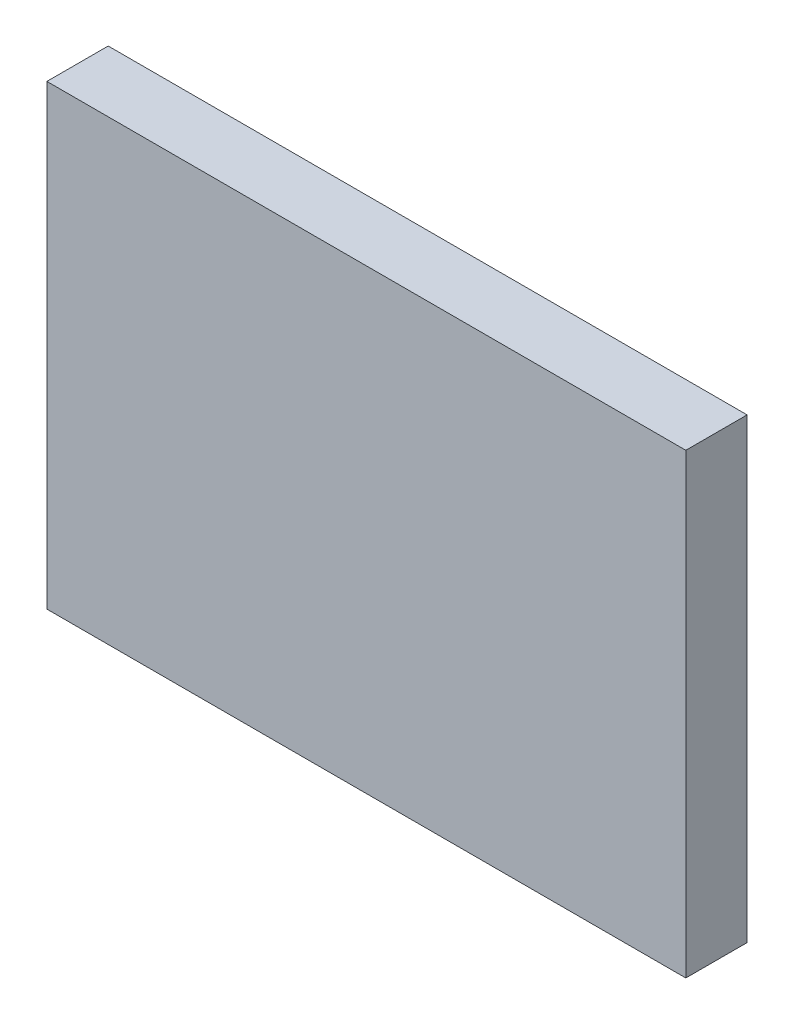
ISO-10303-21;
HEADER;
FILE_DESCRIPTION(('STEP AP214'),'2;1');
FILE_NAME('part.step','',(''),(''),'','','');
FILE_SCHEMA(('AUTOMOTIVE_DESIGN { 1 0 10303 214 1 1 1 1 }'));
ENDSEC;
DATA;
#1=APPLICATION_CONTEXT('core data for automotive mechanical design processes');
#2=APPLICATION_PROTOCOL_DEFINITION('international standard','automotive_design',2000,#1);
#3=PRODUCT_CONTEXT('',#1,'mechanical');
#4=PRODUCT('Part','Part','',(#3));
#5=PRODUCT_RELATED_PRODUCT_CATEGORY('part','',(#4));
#6=PRODUCT_DEFINITION_FORMATION('','',#4);
#7=PRODUCT_DEFINITION_CONTEXT('part definition',#1,'design');
#8=PRODUCT_DEFINITION('design','',#6,#7);
#9=PRODUCT_DEFINITION_SHAPE('','',#8);
#10=(LENGTH_UNIT() NAMED_UNIT(*) SI_UNIT(.MILLI.,.METRE.));
#11=(NAMED_UNIT(*) PLANE_ANGLE_UNIT() SI_UNIT($,.RADIAN.));
#12=(NAMED_UNIT(*) SI_UNIT($,.STERADIAN.) SOLID_ANGLE_UNIT());
#13=UNCERTAINTY_MEASURE_WITH_UNIT(LENGTH_MEASURE(1.E-05),#10,'distance_accuracy_value','');
#14=(GEOMETRIC_REPRESENTATION_CONTEXT(3) GLOBAL_UNCERTAINTY_ASSIGNED_CONTEXT((#13)) GLOBAL_UNIT_ASSIGNED_CONTEXT((#10,
#11,#12)) REPRESENTATION_CONTEXT('',''));
#15=CARTESIAN_POINT('',(0.,0.,0.));
#16=DIRECTION('',(0.,0.,1.));
#17=DIRECTION('',(1.,0.,0.));
#18=AXIS2_PLACEMENT_3D('',#15,#16,#17);
#19=CARTESIAN_POINT('',(0.908095718107407,-0.604008281971269,0.));
#20=DIRECTION('',(0.,1.,0.));
#21=DIRECTION('',(-1.,0.,0.));
#22=AXIS2_PLACEMENT_3D('',#19,#20,#21);
#23=PLANE('',#22);
#24=DIRECTION('',(-1.,0.,0.));
#25=VECTOR('',#24,1.);
#26=CARTESIAN_POINT('',(0.908095718107407,-0.604008281971269,0.));
#27=LINE('',#26,#25);
#28=CARTESIAN_POINT('',(0.908095718107407,-0.604008281971269,0.));
#29=VERTEX_POINT('',#28);
#30=CARTESIAN_POINT('',(0.876829654977122,-0.604008281971269,0.));
#31=VERTEX_POINT('',#30);
#32=EDGE_CURVE('E11',#29,#31,#27,.T.);
#33=ORIENTED_EDGE('',*,*,#32,.T.);
#34=DIRECTION('',(0.,0.,1.));
#35=VECTOR('',#34,1.);
#36=CARTESIAN_POINT('',(0.876829654977122,-0.604008281971269,0.));
#37=LINE('',#36,#35);
#38=CARTESIAN_POINT('',(0.876829654977122,-0.604008281971269,0.003));
#39=VERTEX_POINT('',#38);
#40=EDGE_CURVE('E24',#31,#39,#37,.T.);
#41=ORIENTED_EDGE('',*,*,#40,.T.);
#42=DIRECTION('',(-1.,0.,0.));
#43=VECTOR('',#42,1.);
#44=CARTESIAN_POINT('',(0.908095718107407,-0.604008281971269,0.003));
#45=LINE('',#44,#43);
#46=CARTESIAN_POINT('',(0.908095718107407,-0.604008281971269,0.003));
#47=VERTEX_POINT('',#46);
#48=EDGE_CURVE('E75',#47,#39,#45,.T.);
#49=ORIENTED_EDGE('',*,*,#48,.F.);
#50=DIRECTION('',(0.,0.,1.));
#51=VECTOR('',#50,1.);
#52=CARTESIAN_POINT('',(0.908095718107407,-0.604008281971269,0.));
#53=LINE('',#52,#51);
#54=EDGE_CURVE('E86',#29,#47,#53,.T.);
#55=ORIENTED_EDGE('',*,*,#54,.F.);
#56=EDGE_LOOP('',(#33,#41,#49,#55));
#57=FACE_BOUND('',#56,.T.);
#58=ADVANCED_FACE('F17',(#57),#23,.T.);
#59=CARTESIAN_POINT('',(0.908095718107407,-0.626373786984169,0.));
#60=DIRECTION('',(1.,0.,0.));
#61=DIRECTION('',(0.,1.,0.));
#62=AXIS2_PLACEMENT_3D('',#59,#60,#61);
#63=PLANE('',#62);
#64=DIRECTION('',(0.,1.,0.));
#65=VECTOR('',#64,1.);
#66=CARTESIAN_POINT('',(0.908095718107407,-0.626373786984169,0.));
#67=LINE('',#66,#65);
#68=CARTESIAN_POINT('',(0.908095718107407,-0.626373786984169,0.));
#69=VERTEX_POINT('',#68);
#70=EDGE_CURVE('E83',#69,#29,#67,.T.);
#71=ORIENTED_EDGE('',*,*,#70,.T.);
#72=ORIENTED_EDGE('',*,*,#54,.T.);
#73=DIRECTION('',(0.,1.,0.));
#74=VECTOR('',#73,1.);
#75=CARTESIAN_POINT('',(0.908095718107407,-0.626373786984169,0.003));
#76=LINE('',#75,#74);
#77=CARTESIAN_POINT('',(0.908095718107407,-0.626373786984169,0.003));
#78=VERTEX_POINT('',#77);
#79=EDGE_CURVE('E81',#78,#47,#76,.T.);
#80=ORIENTED_EDGE('',*,*,#79,.F.);
#81=DIRECTION('',(0.,0.,1.));
#82=VECTOR('',#81,1.);
#83=CARTESIAN_POINT('',(0.908095718107407,-0.626373786984169,0.));
#84=LINE('',#83,#82);
#85=EDGE_CURVE('E61',#69,#78,#84,.T.);
#86=ORIENTED_EDGE('',*,*,#85,.F.);
#87=EDGE_LOOP('',(#71,#72,#80,#86));
#88=FACE_BOUND('',#87,.T.);
#89=ADVANCED_FACE('F91',(#88),#63,.T.);
#90=CARTESIAN_POINT('',(0.876829654977122,-0.626373786984169,0.));
#91=DIRECTION('',(0.,-1.,0.));
#92=DIRECTION('',(1.,0.,0.));
#93=AXIS2_PLACEMENT_3D('',#90,#91,#92);
#94=PLANE('',#93);
#95=DIRECTION('',(1.,0.,0.));
#96=VECTOR('',#95,1.);
#97=CARTESIAN_POINT('',(0.876829654977122,-0.626373786984169,0.));
#98=LINE('',#97,#96);
#99=CARTESIAN_POINT('',(0.876829654977122,-0.626373786984169,0.));
#100=VERTEX_POINT('',#99);
#101=EDGE_CURVE('E65',#100,#69,#98,.T.);
#102=ORIENTED_EDGE('',*,*,#101,.T.);
#103=ORIENTED_EDGE('',*,*,#85,.T.);
#104=DIRECTION('',(1.,0.,0.));
#105=VECTOR('',#104,1.);
#106=CARTESIAN_POINT('',(0.876829654977122,-0.626373786984169,0.003));
#107=LINE('',#106,#105);
#108=CARTESIAN_POINT('',(0.876829654977122,-0.626373786984169,0.003));
#109=VERTEX_POINT('',#108);
#110=EDGE_CURVE('E54',#109,#78,#107,.T.);
#111=ORIENTED_EDGE('',*,*,#110,.F.);
#112=DIRECTION('',(0.,0.,1.));
#113=VECTOR('',#112,1.);
#114=CARTESIAN_POINT('',(0.876829654977122,-0.626373786984169,0.));
#115=LINE('',#114,#113);
#116=EDGE_CURVE('E58',#100,#109,#115,.T.);
#117=ORIENTED_EDGE('',*,*,#116,.F.);
#118=EDGE_LOOP('',(#102,#103,#111,#117));
#119=FACE_BOUND('',#118,.T.);
#120=ADVANCED_FACE('F57',(#119),#94,.T.);
#121=CARTESIAN_POINT('',(0.876829654977122,-0.604008281971269,0.));
#122=DIRECTION('',(-1.,0.,0.));
#123=DIRECTION('',(0.,-1.,0.));
#124=AXIS2_PLACEMENT_3D('',#121,#122,#123);
#125=PLANE('',#124);
#126=DIRECTION('',(0.,-1.,0.));
#127=VECTOR('',#126,1.);
#128=CARTESIAN_POINT('',(0.876829654977122,-0.604008281971269,0.));
#129=LINE('',#128,#127);
#130=EDGE_CURVE('E71',#31,#100,#129,.T.);
#131=ORIENTED_EDGE('',*,*,#130,.T.);
#132=ORIENTED_EDGE('',*,*,#116,.T.);
#133=DIRECTION('',(0.,-1.,0.));
#134=VECTOR('',#133,1.);
#135=CARTESIAN_POINT('',(0.876829654977122,-0.604008281971269,0.003));
#136=LINE('',#135,#134);
#137=EDGE_CURVE('E70',#39,#109,#136,.T.);
#138=ORIENTED_EDGE('',*,*,#137,.F.);
#139=ORIENTED_EDGE('',*,*,#40,.F.);
#140=EDGE_LOOP('',(#131,#132,#138,#139));
#141=FACE_BOUND('',#140,.T.);
#142=ADVANCED_FACE('F69',(#141),#125,.T.);
#143=CARTESIAN_POINT('',(0.892462686542264,-0.615191034477719,0.003));
#144=DIRECTION('',(0.,0.,1.));
#145=DIRECTION('',(1.,0.,0.));
#146=AXIS2_PLACEMENT_3D('',#143,#144,#145);
#147=PLANE('',#146);
#148=ORIENTED_EDGE('',*,*,#137,.T.);
#149=ORIENTED_EDGE('',*,*,#110,.T.);
#150=ORIENTED_EDGE('',*,*,#79,.T.);
#151=ORIENTED_EDGE('',*,*,#48,.T.);
#152=EDGE_LOOP('',(#148,#149,#150,#151));
#153=FACE_BOUND('',#152,.T.);
#154=ADVANCED_FACE('F74',(#153),#147,.T.);
#155=CARTESIAN_POINT('',(0.892462686542264,-0.615191034477719,0.));
#156=DIRECTION('',(0.,0.,1.));
#157=DIRECTION('',(1.,0.,0.));
#158=AXIS2_PLACEMENT_3D('',#155,#156,#157);
#159=PLANE('',#158);
#160=ORIENTED_EDGE('',*,*,#130,.F.);
#161=ORIENTED_EDGE('',*,*,#32,.F.);
#162=ORIENTED_EDGE('',*,*,#70,.F.);
#163=ORIENTED_EDGE('',*,*,#101,.F.);
#164=EDGE_LOOP('',(#160,#161,#162,#163));
#165=FACE_BOUND('',#164,.T.);
#166=ADVANCED_FACE('F89',(#165),#159,.F.);
#167=CLOSED_SHELL('',(#58,#89,#120,#142,#154,#166));
#168=MANIFOLD_SOLID_BREP('B1',#167);
#169=ADVANCED_BREP_SHAPE_REPRESENTATION('',(#18,#168),#14);
#170=SHAPE_DEFINITION_REPRESENTATION(#9,#169);
ENDSEC;
END-ISO-10303-21;
